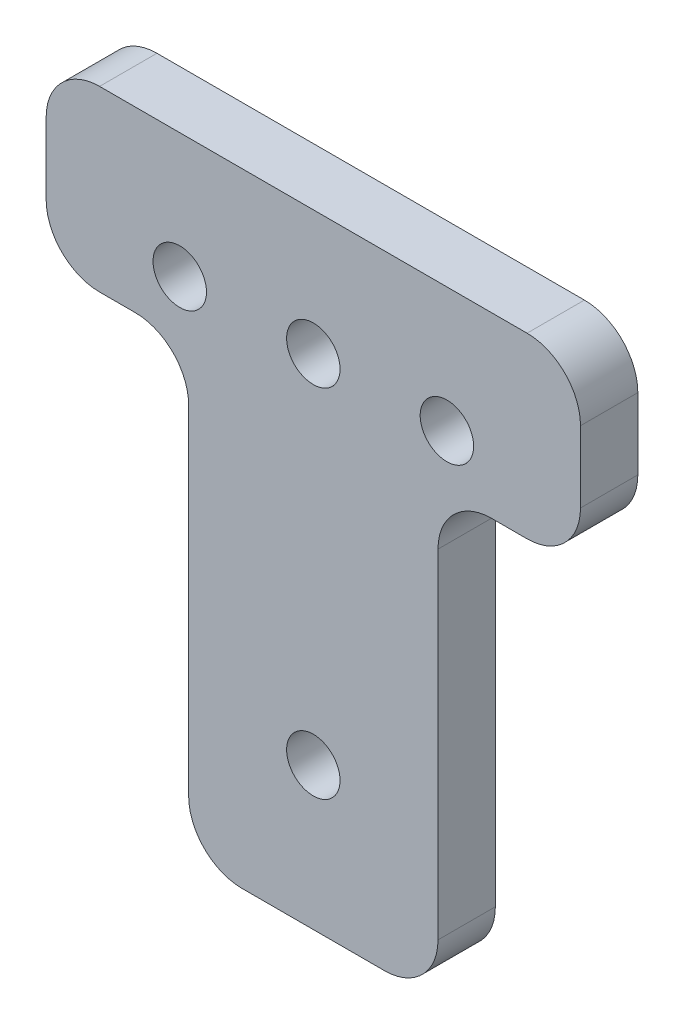
ISO-10303-21;
HEADER;
FILE_DESCRIPTION(('STEP AP214'),'2;1');
FILE_NAME('part.step','',(''),(''),'','','');
FILE_SCHEMA(('AUTOMOTIVE_DESIGN { 1 0 10303 214 1 1 1 1 }'));
ENDSEC;
DATA;
#1=APPLICATION_CONTEXT('core data for automotive mechanical design processes');
#2=APPLICATION_PROTOCOL_DEFINITION('international standard','automotive_design',2000,#1);
#3=PRODUCT_CONTEXT('',#1,'mechanical');
#4=PRODUCT('Part','Part','',(#3));
#5=PRODUCT_RELATED_PRODUCT_CATEGORY('part','',(#4));
#6=PRODUCT_DEFINITION_FORMATION('','',#4);
#7=PRODUCT_DEFINITION_CONTEXT('part definition',#1,'design');
#8=PRODUCT_DEFINITION('design','',#6,#7);
#9=PRODUCT_DEFINITION_SHAPE('','',#8);
#10=(LENGTH_UNIT() NAMED_UNIT(*) SI_UNIT(.MILLI.,.METRE.));
#11=(NAMED_UNIT(*) PLANE_ANGLE_UNIT() SI_UNIT($,.RADIAN.));
#12=(NAMED_UNIT(*) SI_UNIT($,.STERADIAN.) SOLID_ANGLE_UNIT());
#13=UNCERTAINTY_MEASURE_WITH_UNIT(LENGTH_MEASURE(1.E-05),#10,'distance_accuracy_value','');
#14=(GEOMETRIC_REPRESENTATION_CONTEXT(3) GLOBAL_UNCERTAINTY_ASSIGNED_CONTEXT((#13)) GLOBAL_UNIT_ASSIGNED_CONTEXT((#10,
#11,#12)) REPRESENTATION_CONTEXT('',''));
#15=CARTESIAN_POINT('',(0.,0.,0.));
#16=DIRECTION('',(0.,0.,1.));
#17=DIRECTION('',(1.,0.,0.));
#18=AXIS2_PLACEMENT_3D('',#15,#16,#17);
#19=CARTESIAN_POINT('',(0.,0.,1.61));
#20=DIRECTION('',(0.,0.,-1.));
#21=DIRECTION('',(-1.,0.,0.));
#22=AXIS2_PLACEMENT_3D('',#19,#20,#21);
#23=PLANE('',#22);
#24=DIRECTION('',(0.,1.,0.));
#25=VECTOR('',#24,1.);
#26=CARTESIAN_POINT('',(15.,22.5,1.61));
#27=LINE('',#26,#25);
#28=CARTESIAN_POINT('',(15.,15.5,1.61));
#29=VERTEX_POINT('',#28);
#30=CARTESIAN_POINT('',(15.,19.5,1.61));
#31=VERTEX_POINT('',#30);
#32=EDGE_CURVE('E358',#29,#31,#27,.T.);
#33=ORIENTED_EDGE('',*,*,#32,.T.);
#34=CARTESIAN_POINT('',(12.,19.5,1.61));
#35=DIRECTION('',(0.,0.,-1.));
#36=DIRECTION('',(-1.,0.,0.));
#37=AXIS2_PLACEMENT_3D('',#34,#35,#36);
#38=CIRCLE('',#37,3.);
#39=CARTESIAN_POINT('',(12.,22.5,1.61));
#40=VERTEX_POINT('',#39);
#41=EDGE_CURVE('E252',#31,#40,#38,.F.);
#42=ORIENTED_EDGE('',*,*,#41,.T.);
#43=DIRECTION('',(-1.,0.,0.));
#44=VECTOR('',#43,1.);
#45=CARTESIAN_POINT('',(-15.,22.5,1.61));
#46=LINE('',#45,#44);
#47=CARTESIAN_POINT('',(-12.,22.5,1.61));
#48=VERTEX_POINT('',#47);
#49=EDGE_CURVE('E181',#40,#48,#46,.T.);
#50=ORIENTED_EDGE('',*,*,#49,.T.);
#51=CARTESIAN_POINT('',(-12.,19.5,1.61));
#52=DIRECTION('',(0.,0.,-1.));
#53=DIRECTION('',(-1.,0.,0.));
#54=AXIS2_PLACEMENT_3D('',#51,#52,#53);
#55=CIRCLE('',#54,3.);
#56=CARTESIAN_POINT('',(-15.,19.5,1.61));
#57=VERTEX_POINT('',#56);
#58=EDGE_CURVE('E238',#48,#57,#55,.F.);
#59=ORIENTED_EDGE('',*,*,#58,.T.);
#60=DIRECTION('',(0.,-1.,0.));
#61=VECTOR('',#60,1.);
#62=CARTESIAN_POINT('',(-15.,12.5,1.61));
#63=LINE('',#62,#61);
#64=CARTESIAN_POINT('',(-15.,15.5,1.61));
#65=VERTEX_POINT('',#64);
#66=EDGE_CURVE('E330',#57,#65,#63,.T.);
#67=ORIENTED_EDGE('',*,*,#66,.T.);
#68=CARTESIAN_POINT('',(-12.,15.5,1.61));
#69=DIRECTION('',(0.,0.,-1.));
#70=DIRECTION('',(-1.,0.,0.));
#71=AXIS2_PLACEMENT_3D('',#68,#69,#70);
#72=CIRCLE('',#71,3.);
#73=CARTESIAN_POINT('',(-12.,12.5,1.61));
#74=VERTEX_POINT('',#73);
#75=EDGE_CURVE('E241',#65,#74,#72,.F.);
#76=ORIENTED_EDGE('',*,*,#75,.T.);
#77=DIRECTION('',(1.,0.,0.));
#78=VECTOR('',#77,1.);
#79=CARTESIAN_POINT('',(-7.,12.5,1.61));
#80=LINE('',#79,#78);
#81=CARTESIAN_POINT('',(-10.,12.5,1.61));
#82=VERTEX_POINT('',#81);
#83=EDGE_CURVE('E320',#74,#82,#80,.T.);
#84=ORIENTED_EDGE('',*,*,#83,.T.);
#85=CARTESIAN_POINT('',(-10.,9.5,1.61));
#86=DIRECTION('',(0.,0.,-1.));
#87=DIRECTION('',(-1.,0.,0.));
#88=AXIS2_PLACEMENT_3D('',#85,#86,#87);
#89=CIRCLE('',#88,3.);
#90=CARTESIAN_POINT('',(-7.,9.5,1.61));
#91=VERTEX_POINT('',#90);
#92=EDGE_CURVE('E11',#82,#91,#89,.T.);
#93=ORIENTED_EDGE('',*,*,#92,.T.);
#94=DIRECTION('',(0.,-1.,0.));
#95=VECTOR('',#94,1.);
#96=CARTESIAN_POINT('',(-7.,-12.5,1.61));
#97=LINE('',#96,#95);
#98=CARTESIAN_POINT('',(-7.,-9.5,1.61));
#99=VERTEX_POINT('',#98);
#100=EDGE_CURVE('E318',#91,#99,#97,.T.);
#101=ORIENTED_EDGE('',*,*,#100,.T.);
#102=CARTESIAN_POINT('',(-4.,-9.5,1.61));
#103=DIRECTION('',(0.,0.,-1.));
#104=DIRECTION('',(-1.,0.,0.));
#105=AXIS2_PLACEMENT_3D('',#102,#103,#104);
#106=CIRCLE('',#105,3.);
#107=CARTESIAN_POINT('',(-4.,-12.5,1.61));
#108=VERTEX_POINT('',#107);
#109=EDGE_CURVE('E244',#99,#108,#106,.F.);
#110=ORIENTED_EDGE('',*,*,#109,.T.);
#111=DIRECTION('',(1.,0.,0.));
#112=VECTOR('',#111,1.);
#113=CARTESIAN_POINT('',(-7.,-12.5,1.61));
#114=LINE('',#113,#112);
#115=CARTESIAN_POINT('',(4.,-12.5,1.61));
#116=VERTEX_POINT('',#115);
#117=EDGE_CURVE('E325',#108,#116,#114,.T.);
#118=ORIENTED_EDGE('',*,*,#117,.T.);
#119=CARTESIAN_POINT('',(4.,-9.5,1.61));
#120=DIRECTION('',(0.,0.,-1.));
#121=DIRECTION('',(-1.,0.,0.));
#122=AXIS2_PLACEMENT_3D('',#119,#120,#121);
#123=CIRCLE('',#122,3.);
#124=CARTESIAN_POINT('',(7.,-9.5,1.61));
#125=VERTEX_POINT('',#124);
#126=EDGE_CURVE('E68',#116,#125,#123,.F.);
#127=ORIENTED_EDGE('',*,*,#126,.T.);
#128=DIRECTION('',(0.,1.,0.));
#129=VECTOR('',#128,1.);
#130=CARTESIAN_POINT('',(7.,-12.5,1.61));
#131=LINE('',#130,#129);
#132=CARTESIAN_POINT('',(7.,9.5,1.61));
#133=VERTEX_POINT('',#132);
#134=EDGE_CURVE('E218',#125,#133,#131,.T.);
#135=ORIENTED_EDGE('',*,*,#134,.T.);
#136=CARTESIAN_POINT('',(10.,9.5,1.61));
#137=DIRECTION('',(0.,0.,-1.));
#138=DIRECTION('',(-1.,0.,0.));
#139=AXIS2_PLACEMENT_3D('',#136,#137,#138);
#140=CIRCLE('',#139,3.);
#141=CARTESIAN_POINT('',(10.,12.5,1.61));
#142=VERTEX_POINT('',#141);
#143=EDGE_CURVE('E299',#133,#142,#140,.T.);
#144=ORIENTED_EDGE('',*,*,#143,.T.);
#145=DIRECTION('',(1.,0.,0.));
#146=VECTOR('',#145,1.);
#147=CARTESIAN_POINT('',(15.,12.5,1.61));
#148=LINE('',#147,#146);
#149=CARTESIAN_POINT('',(12.,12.5,1.61));
#150=VERTEX_POINT('',#149);
#151=EDGE_CURVE('E216',#142,#150,#148,.T.);
#152=ORIENTED_EDGE('',*,*,#151,.T.);
#153=CARTESIAN_POINT('',(12.,15.5,1.61));
#154=DIRECTION('',(0.,0.,-1.));
#155=DIRECTION('',(-1.,0.,0.));
#156=AXIS2_PLACEMENT_3D('',#153,#154,#155);
#157=CIRCLE('',#156,3.);
#158=EDGE_CURVE('E249',#150,#29,#157,.F.);
#159=ORIENTED_EDGE('',*,*,#158,.T.);
#160=EDGE_LOOP('',(#33,#42,#50,#59,#67,#76,#84,#93,#101,#110,#118,#127,#135,#144,#152,#159));
#161=FACE_BOUND('',#160,.T.);
#162=CARTESIAN_POINT('',(0.,15.5,1.61));
#163=DIRECTION('',(0.,0.,1.));
#164=DIRECTION('',(1.,0.,0.));
#165=AXIS2_PLACEMENT_3D('',#162,#163,#164);
#166=CIRCLE('',#165,1.5);
#167=CARTESIAN_POINT('',(1.5,15.5,1.61));
#168=VERTEX_POINT('',#167);
#169=EDGE_CURVE('E337',#168,#168,#166,.T.);
#170=ORIENTED_EDGE('',*,*,#169,.F.);
#171=EDGE_LOOP('',(#170));
#172=FACE_BOUND('',#171,.T.);
#173=CARTESIAN_POINT('',(-7.5,15.5,1.61));
#174=DIRECTION('',(0.,0.,1.));
#175=DIRECTION('',(1.,0.,0.));
#176=AXIS2_PLACEMENT_3D('',#173,#174,#175);
#177=CIRCLE('',#176,1.5);
#178=CARTESIAN_POINT('',(-6.,15.5,1.61));
#179=VERTEX_POINT('',#178);
#180=EDGE_CURVE('E349',#179,#179,#177,.T.);
#181=ORIENTED_EDGE('',*,*,#180,.F.);
#182=EDGE_LOOP('',(#181));
#183=FACE_BOUND('',#182,.T.);
#184=CARTESIAN_POINT('',(7.5,15.5,1.61));
#185=DIRECTION('',(0.,0.,1.));
#186=DIRECTION('',(1.,0.,0.));
#187=AXIS2_PLACEMENT_3D('',#184,#185,#186);
#188=CIRCLE('',#187,1.5);
#189=CARTESIAN_POINT('',(9.,15.5,1.61));
#190=VERTEX_POINT('',#189);
#191=EDGE_CURVE('E684',#190,#190,#188,.T.);
#192=ORIENTED_EDGE('',*,*,#191,.F.);
#193=EDGE_LOOP('',(#192));
#194=FACE_BOUND('',#193,.T.);
#195=CARTESIAN_POINT('',(0.,-4.5,1.61));
#196=DIRECTION('',(0.,0.,1.));
#197=DIRECTION('',(1.,0.,0.));
#198=AXIS2_PLACEMENT_3D('',#195,#196,#197);
#199=CIRCLE('',#198,1.5);
#200=CARTESIAN_POINT('',(1.5,-4.5,1.61));
#201=VERTEX_POINT('',#200);
#202=EDGE_CURVE('E673',#201,#201,#199,.T.);
#203=ORIENTED_EDGE('',*,*,#202,.F.);
#204=EDGE_LOOP('',(#203));
#205=FACE_BOUND('',#204,.T.);
#206=ADVANCED_FACE('F45',(#161,#172,#183,#194,#205),#23,.F.);
#207=CARTESIAN_POINT('',(0.,0.,-1.61));
#208=DIRECTION('',(0.,0.,-1.));
#209=DIRECTION('',(-1.,0.,0.));
#210=AXIS2_PLACEMENT_3D('',#207,#208,#209);
#211=PLANE('',#210);
#212=CARTESIAN_POINT('',(7.5,15.5,-1.61));
#213=DIRECTION('',(0.,0.,1.));
#214=DIRECTION('',(1.,0.,0.));
#215=AXIS2_PLACEMENT_3D('',#212,#213,#214);
#216=CIRCLE('',#215,1.5);
#217=CARTESIAN_POINT('',(9.,15.5,-1.61));
#218=VERTEX_POINT('',#217);
#219=EDGE_CURVE('E681',#218,#218,#216,.T.);
#220=ORIENTED_EDGE('',*,*,#219,.T.);
#221=EDGE_LOOP('',(#220));
#222=FACE_BOUND('',#221,.T.);
#223=CARTESIAN_POINT('',(0.,15.5,-1.61));
#224=DIRECTION('',(0.,0.,1.));
#225=DIRECTION('',(1.,0.,0.));
#226=AXIS2_PLACEMENT_3D('',#223,#224,#225);
#227=CIRCLE('',#226,1.5);
#228=CARTESIAN_POINT('',(1.5,15.5,-1.61));
#229=VERTEX_POINT('',#228);
#230=EDGE_CURVE('E343',#229,#229,#227,.T.);
#231=ORIENTED_EDGE('',*,*,#230,.T.);
#232=EDGE_LOOP('',(#231));
#233=FACE_BOUND('',#232,.T.);
#234=DIRECTION('',(-1.,0.,0.));
#235=VECTOR('',#234,1.);
#236=CARTESIAN_POINT('',(-15.,22.5,-1.61));
#237=LINE('',#236,#235);
#238=CARTESIAN_POINT('',(12.,22.5,-1.61));
#239=VERTEX_POINT('',#238);
#240=CARTESIAN_POINT('',(-12.,22.5,-1.61));
#241=VERTEX_POINT('',#240);
#242=EDGE_CURVE('E178',#239,#241,#237,.T.);
#243=ORIENTED_EDGE('',*,*,#242,.F.);
#244=CARTESIAN_POINT('',(12.,19.5,-1.61));
#245=DIRECTION('',(0.,0.,-1.));
#246=DIRECTION('',(-1.,0.,0.));
#247=AXIS2_PLACEMENT_3D('',#244,#245,#246);
#248=CIRCLE('',#247,3.);
#249=CARTESIAN_POINT('',(15.,19.5,-1.61));
#250=VERTEX_POINT('',#249);
#251=EDGE_CURVE('E160',#239,#250,#248,.T.);
#252=ORIENTED_EDGE('',*,*,#251,.T.);
#253=DIRECTION('',(0.,1.,0.));
#254=VECTOR('',#253,1.);
#255=CARTESIAN_POINT('',(15.,22.5,-1.61));
#256=LINE('',#255,#254);
#257=CARTESIAN_POINT('',(15.,15.5,-1.61));
#258=VERTEX_POINT('',#257);
#259=EDGE_CURVE('E191',#258,#250,#256,.T.);
#260=ORIENTED_EDGE('',*,*,#259,.F.);
#261=CARTESIAN_POINT('',(12.,15.5,-1.61));
#262=DIRECTION('',(0.,0.,-1.));
#263=DIRECTION('',(-1.,0.,0.));
#264=AXIS2_PLACEMENT_3D('',#261,#262,#263);
#265=CIRCLE('',#264,3.);
#266=CARTESIAN_POINT('',(12.,12.5,-1.61));
#267=VERTEX_POINT('',#266);
#268=EDGE_CURVE('E172',#258,#267,#265,.T.);
#269=ORIENTED_EDGE('',*,*,#268,.T.);
#270=DIRECTION('',(1.,0.,0.));
#271=VECTOR('',#270,1.);
#272=CARTESIAN_POINT('',(15.,12.5,-1.61));
#273=LINE('',#272,#271);
#274=CARTESIAN_POINT('',(10.,12.5,-1.61));
#275=VERTEX_POINT('',#274);
#276=EDGE_CURVE('E198',#275,#267,#273,.T.);
#277=ORIENTED_EDGE('',*,*,#276,.F.);
#278=CARTESIAN_POINT('',(10.,9.5,-1.61));
#279=DIRECTION('',(0.,0.,-1.));
#280=DIRECTION('',(-1.,0.,0.));
#281=AXIS2_PLACEMENT_3D('',#278,#279,#280);
#282=CIRCLE('',#281,3.);
#283=CARTESIAN_POINT('',(7.,9.5,-1.61));
#284=VERTEX_POINT('',#283);
#285=EDGE_CURVE('E296',#275,#284,#282,.F.);
#286=ORIENTED_EDGE('',*,*,#285,.T.);
#287=DIRECTION('',(0.,1.,0.));
#288=VECTOR('',#287,1.);
#289=CARTESIAN_POINT('',(7.,-12.5,-1.61));
#290=LINE('',#289,#288);
#291=CARTESIAN_POINT('',(7.,-9.5,-1.61));
#292=VERTEX_POINT('',#291);
#293=EDGE_CURVE('E213',#292,#284,#290,.T.);
#294=ORIENTED_EDGE('',*,*,#293,.F.);
#295=CARTESIAN_POINT('',(4.,-9.5,-1.61));
#296=DIRECTION('',(0.,0.,-1.));
#297=DIRECTION('',(-1.,0.,0.));
#298=AXIS2_PLACEMENT_3D('',#295,#296,#297);
#299=CIRCLE('',#298,3.);
#300=CARTESIAN_POINT('',(4.,-12.5,-1.61));
#301=VERTEX_POINT('',#300);
#302=EDGE_CURVE('E228',#292,#301,#299,.T.);
#303=ORIENTED_EDGE('',*,*,#302,.T.);
#304=DIRECTION('',(1.,0.,0.));
#305=VECTOR('',#304,1.);
#306=CARTESIAN_POINT('',(-7.,-12.5,-1.61));
#307=LINE('',#306,#305);
#308=CARTESIAN_POINT('',(-4.,-12.5,-1.61));
#309=VERTEX_POINT('',#308);
#310=EDGE_CURVE('E209',#309,#301,#307,.T.);
#311=ORIENTED_EDGE('',*,*,#310,.F.);
#312=CARTESIAN_POINT('',(-4.,-9.5,-1.61));
#313=DIRECTION('',(0.,0.,-1.));
#314=DIRECTION('',(-1.,0.,0.));
#315=AXIS2_PLACEMENT_3D('',#312,#313,#314);
#316=CIRCLE('',#315,3.);
#317=CARTESIAN_POINT('',(-7.,-9.5,-1.61));
#318=VERTEX_POINT('',#317);
#319=EDGE_CURVE('E225',#309,#318,#316,.T.);
#320=ORIENTED_EDGE('',*,*,#319,.T.);
#321=DIRECTION('',(0.,-1.,0.));
#322=VECTOR('',#321,1.);
#323=CARTESIAN_POINT('',(-7.,-12.5,-1.61));
#324=LINE('',#323,#322);
#325=CARTESIAN_POINT('',(-7.,9.5,-1.61));
#326=VERTEX_POINT('',#325);
#327=EDGE_CURVE('E205',#326,#318,#324,.T.);
#328=ORIENTED_EDGE('',*,*,#327,.F.);
#329=CARTESIAN_POINT('',(-10.,9.5,-1.61));
#330=DIRECTION('',(0.,0.,-1.));
#331=DIRECTION('',(-1.,0.,0.));
#332=AXIS2_PLACEMENT_3D('',#329,#330,#331);
#333=CIRCLE('',#332,3.);
#334=CARTESIAN_POINT('',(-10.,12.5,-1.61));
#335=VERTEX_POINT('',#334);
#336=EDGE_CURVE('E54',#326,#335,#333,.F.);
#337=ORIENTED_EDGE('',*,*,#336,.T.);
#338=DIRECTION('',(1.,0.,0.));
#339=VECTOR('',#338,1.);
#340=CARTESIAN_POINT('',(-7.,12.5,-1.61));
#341=LINE('',#340,#339);
#342=CARTESIAN_POINT('',(-12.,12.5,-1.61));
#343=VERTEX_POINT('',#342);
#344=EDGE_CURVE('E196',#343,#335,#341,.T.);
#345=ORIENTED_EDGE('',*,*,#344,.F.);
#346=CARTESIAN_POINT('',(-12.,15.5,-1.61));
#347=DIRECTION('',(0.,0.,-1.));
#348=DIRECTION('',(-1.,0.,0.));
#349=AXIS2_PLACEMENT_3D('',#346,#347,#348);
#350=CIRCLE('',#349,3.);
#351=CARTESIAN_POINT('',(-15.,15.5,-1.61));
#352=VERTEX_POINT('',#351);
#353=EDGE_CURVE('E222',#343,#352,#350,.T.);
#354=ORIENTED_EDGE('',*,*,#353,.T.);
#355=DIRECTION('',(0.,-1.,0.));
#356=VECTOR('',#355,1.);
#357=CARTESIAN_POINT('',(-15.,12.5,-1.61));
#358=LINE('',#357,#356);
#359=CARTESIAN_POINT('',(-15.,19.5,-1.61));
#360=VERTEX_POINT('',#359);
#361=EDGE_CURVE('E190',#360,#352,#358,.T.);
#362=ORIENTED_EDGE('',*,*,#361,.F.);
#363=CARTESIAN_POINT('',(-12.,19.5,-1.61));
#364=DIRECTION('',(0.,0.,-1.));
#365=DIRECTION('',(-1.,0.,0.));
#366=AXIS2_PLACEMENT_3D('',#363,#364,#365);
#367=CIRCLE('',#366,3.);
#368=EDGE_CURVE('E183',#360,#241,#367,.T.);
#369=ORIENTED_EDGE('',*,*,#368,.T.);
#370=EDGE_LOOP('',(#243,#252,#260,#269,#277,#286,#294,#303,#311,#320,#328,#337,#345,#354,#362,#369));
#371=FACE_BOUND('',#370,.T.);
#372=CARTESIAN_POINT('',(-7.5,15.5,-1.61));
#373=DIRECTION('',(0.,0.,1.));
#374=DIRECTION('',(1.,0.,0.));
#375=AXIS2_PLACEMENT_3D('',#372,#373,#374);
#376=CIRCLE('',#375,1.5);
#377=CARTESIAN_POINT('',(-6.,15.5,-1.61));
#378=VERTEX_POINT('',#377);
#379=EDGE_CURVE('E352',#378,#378,#376,.T.);
#380=ORIENTED_EDGE('',*,*,#379,.T.);
#381=EDGE_LOOP('',(#380));
#382=FACE_BOUND('',#381,.T.);
#383=CARTESIAN_POINT('',(0.,-4.5,-1.61));
#384=DIRECTION('',(0.,0.,1.));
#385=DIRECTION('',(1.,0.,0.));
#386=AXIS2_PLACEMENT_3D('',#383,#384,#385);
#387=CIRCLE('',#386,1.5);
#388=CARTESIAN_POINT('',(1.5,-4.5,-1.61));
#389=VERTEX_POINT('',#388);
#390=EDGE_CURVE('E676',#389,#389,#387,.T.);
#391=ORIENTED_EDGE('',*,*,#390,.T.);
#392=EDGE_LOOP('',(#391));
#393=FACE_BOUND('',#392,.T.);
#394=ADVANCED_FACE('F186',(#222,#233,#371,#382,#393),#211,.T.);
#395=CARTESIAN_POINT('',(15.,12.5,1.61));
#396=DIRECTION('',(0.,1.,0.));
#397=DIRECTION('',(0.,0.,1.));
#398=AXIS2_PLACEMENT_3D('',#395,#396,#397);
#399=PLANE('',#398);
#400=ORIENTED_EDGE('',*,*,#276,.T.);
#401=DIRECTION('',(0.,0.,-1.));
#402=VECTOR('',#401,1.);
#403=CARTESIAN_POINT('',(12.,12.5,1.61));
#404=LINE('',#403,#402);
#405=EDGE_CURVE('E259',#267,#150,#404,.F.);
#406=ORIENTED_EDGE('',*,*,#405,.T.);
#407=ORIENTED_EDGE('',*,*,#151,.F.);
#408=DIRECTION('',(0.,0.,-1.));
#409=VECTOR('',#408,1.);
#410=CARTESIAN_POINT('',(10.,12.5,-1.61));
#411=LINE('',#410,#409);
#412=EDGE_CURVE('E255',#142,#275,#411,.T.);
#413=ORIENTED_EDGE('',*,*,#412,.T.);
#414=EDGE_LOOP('',(#400,#406,#407,#413));
#415=FACE_BOUND('',#414,.T.);
#416=ADVANCED_FACE('F389',(#415),#399,.F.);
#417=CARTESIAN_POINT('',(15.,22.5,1.61));
#418=DIRECTION('',(-1.,0.,0.));
#419=DIRECTION('',(0.,0.,1.));
#420=AXIS2_PLACEMENT_3D('',#417,#418,#419);
#421=PLANE('',#420);
#422=ORIENTED_EDGE('',*,*,#259,.T.);
#423=DIRECTION('',(0.,0.,-1.));
#424=VECTOR('',#423,1.);
#425=CARTESIAN_POINT('',(15.,19.5,1.61));
#426=LINE('',#425,#424);
#427=EDGE_CURVE('E165',#250,#31,#426,.F.);
#428=ORIENTED_EDGE('',*,*,#427,.T.);
#429=ORIENTED_EDGE('',*,*,#32,.F.);
#430=DIRECTION('',(0.,0.,-1.));
#431=VECTOR('',#430,1.);
#432=CARTESIAN_POINT('',(15.,15.5,1.61));
#433=LINE('',#432,#431);
#434=EDGE_CURVE('E171',#29,#258,#433,.T.);
#435=ORIENTED_EDGE('',*,*,#434,.T.);
#436=EDGE_LOOP('',(#422,#428,#429,#435));
#437=FACE_BOUND('',#436,.T.);
#438=ADVANCED_FACE('F378',(#437),#421,.F.);
#439=CARTESIAN_POINT('',(-15.,22.5,1.61));
#440=DIRECTION('',(0.,-1.,0.));
#441=DIRECTION('',(0.,0.,-1.));
#442=AXIS2_PLACEMENT_3D('',#439,#440,#441);
#443=PLANE('',#442);
#444=ORIENTED_EDGE('',*,*,#49,.F.);
#445=DIRECTION('',(0.,0.,-1.));
#446=VECTOR('',#445,1.);
#447=CARTESIAN_POINT('',(12.,22.5,1.61));
#448=LINE('',#447,#446);
#449=EDGE_CURVE('E164',#40,#239,#448,.T.);
#450=ORIENTED_EDGE('',*,*,#449,.T.);
#451=ORIENTED_EDGE('',*,*,#242,.T.);
#452=DIRECTION('',(0.,0.,-1.));
#453=VECTOR('',#452,1.);
#454=CARTESIAN_POINT('',(-12.,22.5,1.61));
#455=LINE('',#454,#453);
#456=EDGE_CURVE('E184',#241,#48,#455,.F.);
#457=ORIENTED_EDGE('',*,*,#456,.T.);
#458=EDGE_LOOP('',(#444,#450,#451,#457));
#459=FACE_BOUND('',#458,.T.);
#460=ADVANCED_FACE('F177',(#459),#443,.F.);
#461=CARTESIAN_POINT('',(-15.,12.5,1.61));
#462=DIRECTION('',(1.,0.,0.));
#463=DIRECTION('',(0.,0.,-1.));
#464=AXIS2_PLACEMENT_3D('',#461,#462,#463);
#465=PLANE('',#464);
#466=ORIENTED_EDGE('',*,*,#361,.T.);
#467=DIRECTION('',(0.,0.,-1.));
#468=VECTOR('',#467,1.);
#469=CARTESIAN_POINT('',(-15.,15.5,1.61));
#470=LINE('',#469,#468);
#471=EDGE_CURVE('E293',#352,#65,#470,.F.);
#472=ORIENTED_EDGE('',*,*,#471,.T.);
#473=ORIENTED_EDGE('',*,*,#66,.F.);
#474=DIRECTION('',(0.,0.,-1.));
#475=VECTOR('',#474,1.);
#476=CARTESIAN_POINT('',(-15.,19.5,1.61));
#477=LINE('',#476,#475);
#478=EDGE_CURVE('E289',#57,#360,#477,.T.);
#479=ORIENTED_EDGE('',*,*,#478,.T.);
#480=EDGE_LOOP('',(#466,#472,#473,#479));
#481=FACE_BOUND('',#480,.T.);
#482=ADVANCED_FACE('F372',(#481),#465,.F.);
#483=CARTESIAN_POINT('',(-7.,12.5,1.61));
#484=DIRECTION('',(0.,1.,0.));
#485=DIRECTION('',(0.,0.,1.));
#486=AXIS2_PLACEMENT_3D('',#483,#484,#485);
#487=PLANE('',#486);
#488=ORIENTED_EDGE('',*,*,#344,.T.);
#489=DIRECTION('',(0.,0.,-1.));
#490=VECTOR('',#489,1.);
#491=CARTESIAN_POINT('',(-10.,12.5,1.61));
#492=LINE('',#491,#490);
#493=EDGE_CURVE('E286',#335,#82,#492,.F.);
#494=ORIENTED_EDGE('',*,*,#493,.T.);
#495=ORIENTED_EDGE('',*,*,#83,.F.);
#496=DIRECTION('',(0.,0.,-1.));
#497=VECTOR('',#496,1.);
#498=CARTESIAN_POINT('',(-12.,12.5,1.61));
#499=LINE('',#498,#497);
#500=EDGE_CURVE('E282',#74,#343,#499,.T.);
#501=ORIENTED_EDGE('',*,*,#500,.T.);
#502=EDGE_LOOP('',(#488,#494,#495,#501));
#503=FACE_BOUND('',#502,.T.);
#504=ADVANCED_FACE('F308',(#503),#487,.F.);
#505=CARTESIAN_POINT('',(-7.,-12.5,1.61));
#506=DIRECTION('',(1.,0.,0.));
#507=DIRECTION('',(0.,0.,-1.));
#508=AXIS2_PLACEMENT_3D('',#505,#506,#507);
#509=PLANE('',#508);
#510=ORIENTED_EDGE('',*,*,#327,.T.);
#511=DIRECTION('',(0.,0.,-1.));
#512=VECTOR('',#511,1.);
#513=CARTESIAN_POINT('',(-7.,-9.5,1.61));
#514=LINE('',#513,#512);
#515=EDGE_CURVE('E279',#318,#99,#514,.F.);
#516=ORIENTED_EDGE('',*,*,#515,.T.);
#517=ORIENTED_EDGE('',*,*,#100,.F.);
#518=DIRECTION('',(0.,0.,-1.));
#519=VECTOR('',#518,1.);
#520=CARTESIAN_POINT('',(-7.,9.5,-1.61));
#521=LINE('',#520,#519);
#522=EDGE_CURVE('E275',#91,#326,#521,.T.);
#523=ORIENTED_EDGE('',*,*,#522,.T.);
#524=EDGE_LOOP('',(#510,#516,#517,#523));
#525=FACE_BOUND('',#524,.T.);
#526=ADVANCED_FACE('F322',(#525),#509,.F.);
#527=CARTESIAN_POINT('',(-7.,-12.5,1.61));
#528=DIRECTION('',(0.,1.,0.));
#529=DIRECTION('',(0.,0.,1.));
#530=AXIS2_PLACEMENT_3D('',#527,#528,#529);
#531=PLANE('',#530);
#532=ORIENTED_EDGE('',*,*,#310,.T.);
#533=DIRECTION('',(0.,0.,-1.));
#534=VECTOR('',#533,1.);
#535=CARTESIAN_POINT('',(4.,-12.5,1.61));
#536=LINE('',#535,#534);
#537=EDGE_CURVE('E272',#301,#116,#536,.F.);
#538=ORIENTED_EDGE('',*,*,#537,.T.);
#539=ORIENTED_EDGE('',*,*,#117,.F.);
#540=DIRECTION('',(0.,0.,-1.));
#541=VECTOR('',#540,1.);
#542=CARTESIAN_POINT('',(-4.,-12.5,1.61));
#543=LINE('',#542,#541);
#544=EDGE_CURVE('E268',#108,#309,#543,.T.);
#545=ORIENTED_EDGE('',*,*,#544,.T.);
#546=EDGE_LOOP('',(#532,#538,#539,#545));
#547=FACE_BOUND('',#546,.T.);
#548=ADVANCED_FACE('F410',(#547),#531,.F.);
#549=CARTESIAN_POINT('',(7.,-12.5,1.61));
#550=DIRECTION('',(-1.,0.,0.));
#551=DIRECTION('',(0.,0.,1.));
#552=AXIS2_PLACEMENT_3D('',#549,#550,#551);
#553=PLANE('',#552);
#554=ORIENTED_EDGE('',*,*,#293,.T.);
#555=DIRECTION('',(0.,0.,-1.));
#556=VECTOR('',#555,1.);
#557=CARTESIAN_POINT('',(7.,9.5,1.61));
#558=LINE('',#557,#556);
#559=EDGE_CURVE('E61',#284,#133,#558,.F.);
#560=ORIENTED_EDGE('',*,*,#559,.T.);
#561=ORIENTED_EDGE('',*,*,#134,.F.);
#562=DIRECTION('',(0.,0.,-1.));
#563=VECTOR('',#562,1.);
#564=CARTESIAN_POINT('',(7.,-9.5,1.61));
#565=LINE('',#564,#563);
#566=EDGE_CURVE('E262',#125,#292,#565,.T.);
#567=ORIENTED_EDGE('',*,*,#566,.T.);
#568=EDGE_LOOP('',(#554,#560,#561,#567));
#569=FACE_BOUND('',#568,.T.);
#570=ADVANCED_FACE('F384',(#569),#553,.F.);
#571=CARTESIAN_POINT('',(0.,15.5,1.61));
#572=DIRECTION('',(0.,0.,-1.));
#573=DIRECTION('',(-1.,0.,0.));
#574=AXIS2_PLACEMENT_3D('',#571,#572,#573);
#575=CYLINDRICAL_SURFACE('',#574,1.5);
#576=ORIENTED_EDGE('',*,*,#169,.T.);
#577=EDGE_LOOP('',(#576));
#578=FACE_BOUND('',#577,.T.);
#579=ORIENTED_EDGE('',*,*,#230,.F.);
#580=EDGE_LOOP('',(#579));
#581=FACE_BOUND('',#580,.T.);
#582=ADVANCED_FACE('F405',(#578,#581),#575,.F.);
#583=CARTESIAN_POINT('',(-7.5,15.5,1.61));
#584=DIRECTION('',(0.,0.,-1.));
#585=DIRECTION('',(-1.,0.,0.));
#586=AXIS2_PLACEMENT_3D('',#583,#584,#585);
#587=CYLINDRICAL_SURFACE('',#586,1.5);
#588=ORIENTED_EDGE('',*,*,#180,.T.);
#589=EDGE_LOOP('',(#588));
#590=FACE_BOUND('',#589,.T.);
#591=ORIENTED_EDGE('',*,*,#379,.F.);
#592=EDGE_LOOP('',(#591));
#593=FACE_BOUND('',#592,.T.);
#594=ADVANCED_FACE('F451',(#590,#593),#587,.F.);
#595=CARTESIAN_POINT('',(7.5,15.5,1.61));
#596=DIRECTION('',(0.,0.,-1.));
#597=DIRECTION('',(-1.,0.,0.));
#598=AXIS2_PLACEMENT_3D('',#595,#596,#597);
#599=CYLINDRICAL_SURFACE('',#598,1.5);
#600=ORIENTED_EDGE('',*,*,#191,.T.);
#601=EDGE_LOOP('',(#600));
#602=FACE_BOUND('',#601,.T.);
#603=ORIENTED_EDGE('',*,*,#219,.F.);
#604=EDGE_LOOP('',(#603));
#605=FACE_BOUND('',#604,.T.);
#606=ADVANCED_FACE('F457',(#602,#605),#599,.F.);
#607=CARTESIAN_POINT('',(0.,-4.5,1.61));
#608=DIRECTION('',(0.,0.,-1.));
#609=DIRECTION('',(-1.,0.,0.));
#610=AXIS2_PLACEMENT_3D('',#607,#608,#609);
#611=CYLINDRICAL_SURFACE('',#610,1.5);
#612=ORIENTED_EDGE('',*,*,#202,.T.);
#613=EDGE_LOOP('',(#612));
#614=FACE_BOUND('',#613,.T.);
#615=ORIENTED_EDGE('',*,*,#390,.F.);
#616=EDGE_LOOP('',(#615));
#617=FACE_BOUND('',#616,.T.);
#618=ADVANCED_FACE('F464',(#614,#617),#611,.F.);
#619=CARTESIAN_POINT('',(12.,19.5,1.61));
#620=DIRECTION('',(0.,0.,-1.));
#621=DIRECTION('',(-1.,0.,0.));
#622=AXIS2_PLACEMENT_3D('',#619,#620,#621);
#623=CYLINDRICAL_SURFACE('',#622,3.);
#624=ORIENTED_EDGE('',*,*,#41,.F.);
#625=ORIENTED_EDGE('',*,*,#427,.F.);
#626=ORIENTED_EDGE('',*,*,#251,.F.);
#627=ORIENTED_EDGE('',*,*,#449,.F.);
#628=EDGE_LOOP('',(#624,#625,#626,#627));
#629=FACE_BOUND('',#628,.T.);
#630=ADVANCED_FACE('F163',(#629),#623,.T.);
#631=CARTESIAN_POINT('',(12.,15.5,1.61));
#632=DIRECTION('',(0.,0.,-1.));
#633=DIRECTION('',(-1.,0.,0.));
#634=AXIS2_PLACEMENT_3D('',#631,#632,#633);
#635=CYLINDRICAL_SURFACE('',#634,3.);
#636=ORIENTED_EDGE('',*,*,#158,.F.);
#637=ORIENTED_EDGE('',*,*,#405,.F.);
#638=ORIENTED_EDGE('',*,*,#268,.F.);
#639=ORIENTED_EDGE('',*,*,#434,.F.);
#640=EDGE_LOOP('',(#636,#637,#638,#639));
#641=FACE_BOUND('',#640,.T.);
#642=ADVANCED_FACE('F380',(#641),#635,.T.);
#643=CARTESIAN_POINT('',(10.,9.5,1.61));
#644=DIRECTION('',(0.,0.,1.));
#645=DIRECTION('',(1.,0.,0.));
#646=AXIS2_PLACEMENT_3D('',#643,#644,#645);
#647=CYLINDRICAL_SURFACE('',#646,3.);
#648=ORIENTED_EDGE('',*,*,#143,.F.);
#649=ORIENTED_EDGE('',*,*,#559,.F.);
#650=ORIENTED_EDGE('',*,*,#285,.F.);
#651=ORIENTED_EDGE('',*,*,#412,.F.);
#652=EDGE_LOOP('',(#648,#649,#650,#651));
#653=FACE_BOUND('',#652,.T.);
#654=ADVANCED_FACE('F387',(#653),#647,.F.);
#655=CARTESIAN_POINT('',(4.,-9.5,1.61));
#656=DIRECTION('',(0.,0.,-1.));
#657=DIRECTION('',(-1.,0.,0.));
#658=AXIS2_PLACEMENT_3D('',#655,#656,#657);
#659=CYLINDRICAL_SURFACE('',#658,3.);
#660=ORIENTED_EDGE('',*,*,#126,.F.);
#661=ORIENTED_EDGE('',*,*,#537,.F.);
#662=ORIENTED_EDGE('',*,*,#302,.F.);
#663=ORIENTED_EDGE('',*,*,#566,.F.);
#664=EDGE_LOOP('',(#660,#661,#662,#663));
#665=FACE_BOUND('',#664,.T.);
#666=ADVANCED_FACE('F490',(#665),#659,.T.);
#667=CARTESIAN_POINT('',(-4.,-9.5,1.61));
#668=DIRECTION('',(0.,0.,-1.));
#669=DIRECTION('',(-1.,0.,0.));
#670=AXIS2_PLACEMENT_3D('',#667,#668,#669);
#671=CYLINDRICAL_SURFACE('',#670,3.);
#672=ORIENTED_EDGE('',*,*,#109,.F.);
#673=ORIENTED_EDGE('',*,*,#515,.F.);
#674=ORIENTED_EDGE('',*,*,#319,.F.);
#675=ORIENTED_EDGE('',*,*,#544,.F.);
#676=EDGE_LOOP('',(#672,#673,#674,#675));
#677=FACE_BOUND('',#676,.T.);
#678=ADVANCED_FACE('F497',(#677),#671,.T.);
#679=CARTESIAN_POINT('',(-10.,9.5,1.61));
#680=DIRECTION('',(0.,0.,1.));
#681=DIRECTION('',(1.,0.,0.));
#682=AXIS2_PLACEMENT_3D('',#679,#680,#681);
#683=CYLINDRICAL_SURFACE('',#682,3.);
#684=ORIENTED_EDGE('',*,*,#92,.F.);
#685=ORIENTED_EDGE('',*,*,#493,.F.);
#686=ORIENTED_EDGE('',*,*,#336,.F.);
#687=ORIENTED_EDGE('',*,*,#522,.F.);
#688=EDGE_LOOP('',(#684,#685,#686,#687));
#689=FACE_BOUND('',#688,.T.);
#690=ADVANCED_FACE('F313',(#689),#683,.F.);
#691=CARTESIAN_POINT('',(-12.,15.5,1.61));
#692=DIRECTION('',(0.,0.,-1.));
#693=DIRECTION('',(-1.,0.,0.));
#694=AXIS2_PLACEMENT_3D('',#691,#692,#693);
#695=CYLINDRICAL_SURFACE('',#694,3.);
#696=ORIENTED_EDGE('',*,*,#75,.F.);
#697=ORIENTED_EDGE('',*,*,#471,.F.);
#698=ORIENTED_EDGE('',*,*,#353,.F.);
#699=ORIENTED_EDGE('',*,*,#500,.F.);
#700=EDGE_LOOP('',(#696,#697,#698,#699));
#701=FACE_BOUND('',#700,.T.);
#702=ADVANCED_FACE('F371',(#701),#695,.T.);
#703=CARTESIAN_POINT('',(-12.,19.5,1.61));
#704=DIRECTION('',(0.,0.,-1.));
#705=DIRECTION('',(-1.,0.,0.));
#706=AXIS2_PLACEMENT_3D('',#703,#704,#705);
#707=CYLINDRICAL_SURFACE('',#706,3.);
#708=ORIENTED_EDGE('',*,*,#58,.F.);
#709=ORIENTED_EDGE('',*,*,#456,.F.);
#710=ORIENTED_EDGE('',*,*,#368,.F.);
#711=ORIENTED_EDGE('',*,*,#478,.F.);
#712=EDGE_LOOP('',(#708,#709,#710,#711));
#713=FACE_BOUND('',#712,.T.);
#714=ADVANCED_FACE('F47',(#713),#707,.T.);
#715=CLOSED_SHELL('',(#206,#394,#416,#438,#460,#482,#504,#526,#548,#570,#582,#594,#606,#618,
#630,#642,#654,#666,#678,#690,#702,#714));
#716=MANIFOLD_SOLID_BREP('B2',#715);
#717=ADVANCED_BREP_SHAPE_REPRESENTATION('',(#18,#716),#14);
#718=SHAPE_DEFINITION_REPRESENTATION(#9,#717);
ENDSEC;
END-ISO-10303-21;
